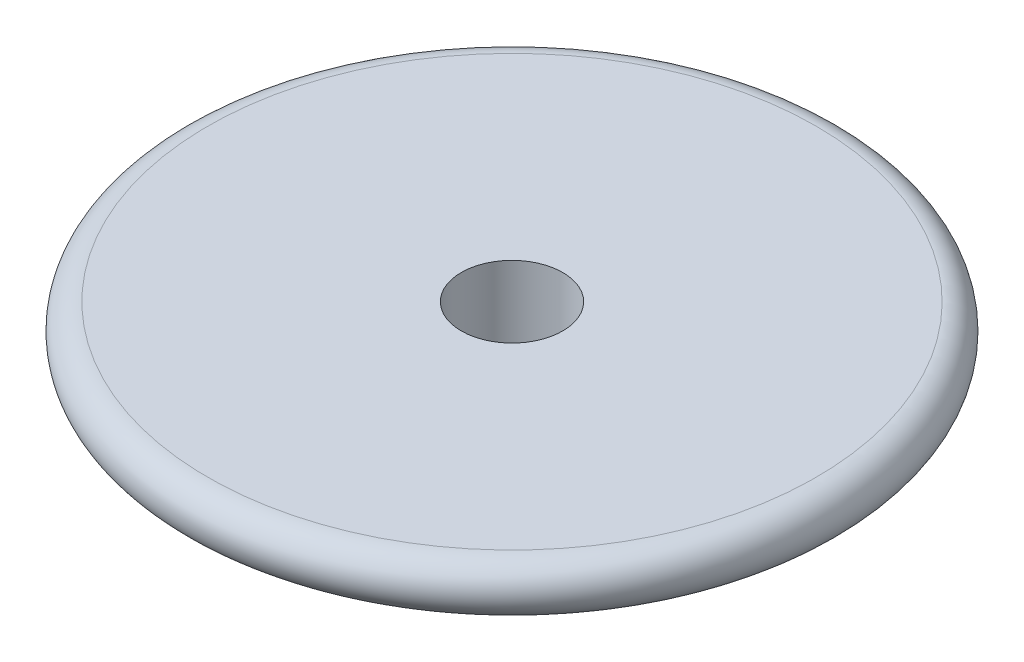
ISO-10303-21;
HEADER;
FILE_DESCRIPTION(('STEP AP214'),'2;1');
FILE_NAME('part.step','',(''),(''),'','','');
FILE_SCHEMA(('AUTOMOTIVE_DESIGN { 1 0 10303 214 1 1 1 1 }'));
ENDSEC;
DATA;
#1=APPLICATION_CONTEXT('core data for automotive mechanical design processes');
#2=APPLICATION_PROTOCOL_DEFINITION('international standard','automotive_design',2000,#1);
#3=PRODUCT_CONTEXT('',#1,'mechanical');
#4=PRODUCT('Part','Part','',(#3));
#5=PRODUCT_RELATED_PRODUCT_CATEGORY('part','',(#4));
#6=PRODUCT_DEFINITION_FORMATION('','',#4);
#7=PRODUCT_DEFINITION_CONTEXT('part definition',#1,'design');
#8=PRODUCT_DEFINITION('design','',#6,#7);
#9=PRODUCT_DEFINITION_SHAPE('','',#8);
#10=(LENGTH_UNIT() NAMED_UNIT(*) SI_UNIT(.MILLI.,.METRE.));
#11=(NAMED_UNIT(*) PLANE_ANGLE_UNIT() SI_UNIT($,.RADIAN.));
#12=(NAMED_UNIT(*) SI_UNIT($,.STERADIAN.) SOLID_ANGLE_UNIT());
#13=UNCERTAINTY_MEASURE_WITH_UNIT(LENGTH_MEASURE(1.E-05),#10,'distance_accuracy_value','');
#14=(GEOMETRIC_REPRESENTATION_CONTEXT(3) GLOBAL_UNCERTAINTY_ASSIGNED_CONTEXT((#13)) GLOBAL_UNIT_ASSIGNED_CONTEXT((#10,
#11,#12)) REPRESENTATION_CONTEXT('',''));
#15=CARTESIAN_POINT('',(0.,0.,0.));
#16=DIRECTION('',(0.,0.,1.));
#17=DIRECTION('',(1.,0.,0.));
#18=AXIS2_PLACEMENT_3D('',#15,#16,#17);
#19=CARTESIAN_POINT('',(0.,33.9999999999999,0.));
#20=DIRECTION('',(0.,-1.,0.));
#21=DIRECTION('',(0.,0.,1.));
#22=AXIS2_PLACEMENT_3D('',#19,#20,#21);
#23=SPHERICAL_SURFACE('',#22,37.9999999999999);
#24=CARTESIAN_POINT('',(0.,-3.94733192202056,0.));
#25=DIRECTION('',(0.,1.,0.));
#26=DIRECTION('',(0.,0.,1.));
#27=AXIS2_PLACEMENT_3D('',#24,#25,#26);
#28=CIRCLE('',#27,2.);
#29=CARTESIAN_POINT('',(0.,-3.94733192202056,2.));
#30=VERTEX_POINT('',#29);
#31=EDGE_CURVE('E40',#30,#30,#28,.T.);
#32=ORIENTED_EDGE('',*,*,#31,.T.);
#33=EDGE_LOOP('',(#32));
#34=FACE_BOUND('',#33,.T.);
#35=CARTESIAN_POINT('',(0.,-1.94594594594595,0.));
#36=DIRECTION('',(0.,-1.,0.));
#37=DIRECTION('',(0.,0.,-1.));
#38=AXIS2_PLACEMENT_3D('',#35,#36,#37);
#39=CIRCLE('',#38,12.3243243243243);
#40=CARTESIAN_POINT('',(0.,-1.94594594594595,-12.3243243243243));
#41=VERTEX_POINT('',#40);
#42=EDGE_CURVE('E36',#41,#41,#39,.T.);
#43=ORIENTED_EDGE('',*,*,#42,.T.);
#44=EDGE_LOOP('',(#43));
#45=FACE_BOUND('',#44,.T.);
#46=ADVANCED_FACE('F30',(#34,#45),#23,.T.);
#47=CARTESIAN_POINT('',(0.,0.,0.));
#48=DIRECTION('',(0.,-1.,0.));
#49=DIRECTION('',(0.,0.,-1.));
#50=AXIS2_PLACEMENT_3D('',#47,#48,#49);
#51=PLANE('',#50);
#52=CARTESIAN_POINT('',(0.,0.,0.));
#53=DIRECTION('',(0.,1.,0.));
#54=DIRECTION('',(0.,0.,1.));
#55=AXIS2_PLACEMENT_3D('',#52,#53,#54);
#56=CIRCLE('',#55,2.);
#57=CARTESIAN_POINT('',(0.,0.,2.));
#58=VERTEX_POINT('',#57);
#59=EDGE_CURVE('E44',#58,#58,#56,.T.);
#60=ORIENTED_EDGE('',*,*,#59,.F.);
#61=EDGE_LOOP('',(#60));
#62=FACE_BOUND('',#61,.T.);
#63=CARTESIAN_POINT('',(0.,0.,0.));
#64=DIRECTION('',(0.,-1.,0.));
#65=DIRECTION('',(0.,0.,-1.));
#66=AXIS2_PLACEMENT_3D('',#63,#64,#65);
#67=CIRCLE('',#66,12.);
#68=CARTESIAN_POINT('',(0.,0.,-12.));
#69=VERTEX_POINT('',#68);
#70=EDGE_CURVE('E10',#69,#69,#67,.T.);
#71=ORIENTED_EDGE('',*,*,#70,.F.);
#72=EDGE_LOOP('',(#71));
#73=FACE_BOUND('',#72,.T.);
#74=ADVANCED_FACE('F53',(#62,#73),#51,.F.);
#75=CARTESIAN_POINT('',(0.,-1.,0.));
#76=DIRECTION('',(0.,-1.,0.));
#77=DIRECTION('',(0.,0.,-1.));
#78=AXIS2_PLACEMENT_3D('',#75,#76,#77);
#79=TOROIDAL_SURFACE('',#78,12.,1.);
#80=ORIENTED_EDGE('',*,*,#42,.F.);
#81=EDGE_LOOP('',(#80));
#82=FACE_BOUND('',#81,.T.);
#83=ORIENTED_EDGE('',*,*,#70,.T.);
#84=EDGE_LOOP('',(#83));
#85=FACE_BOUND('',#84,.T.);
#86=ADVANCED_FACE('F56',(#82,#85),#79,.T.);
#87=CARTESIAN_POINT('',(0.,-4.,0.));
#88=DIRECTION('',(0.,1.,0.));
#89=DIRECTION('',(0.,0.,1.));
#90=AXIS2_PLACEMENT_3D('',#87,#88,#89);
#91=CYLINDRICAL_SURFACE('',#90,2.);
#92=ORIENTED_EDGE('',*,*,#59,.T.);
#93=EDGE_LOOP('',(#92));
#94=FACE_BOUND('',#93,.T.);
#95=ORIENTED_EDGE('',*,*,#31,.F.);
#96=EDGE_LOOP('',(#95));
#97=FACE_BOUND('',#96,.T.);
#98=ADVANCED_FACE('F50',(#94,#97),#91,.F.);
#99=CLOSED_SHELL('',(#46,#74,#86,#98));
#100=MANIFOLD_SOLID_BREP('B2',#99);
#101=ADVANCED_BREP_SHAPE_REPRESENTATION('',(#18,#100),#14);
#102=SHAPE_DEFINITION_REPRESENTATION(#9,#101);
ENDSEC;
END-ISO-10303-21;
